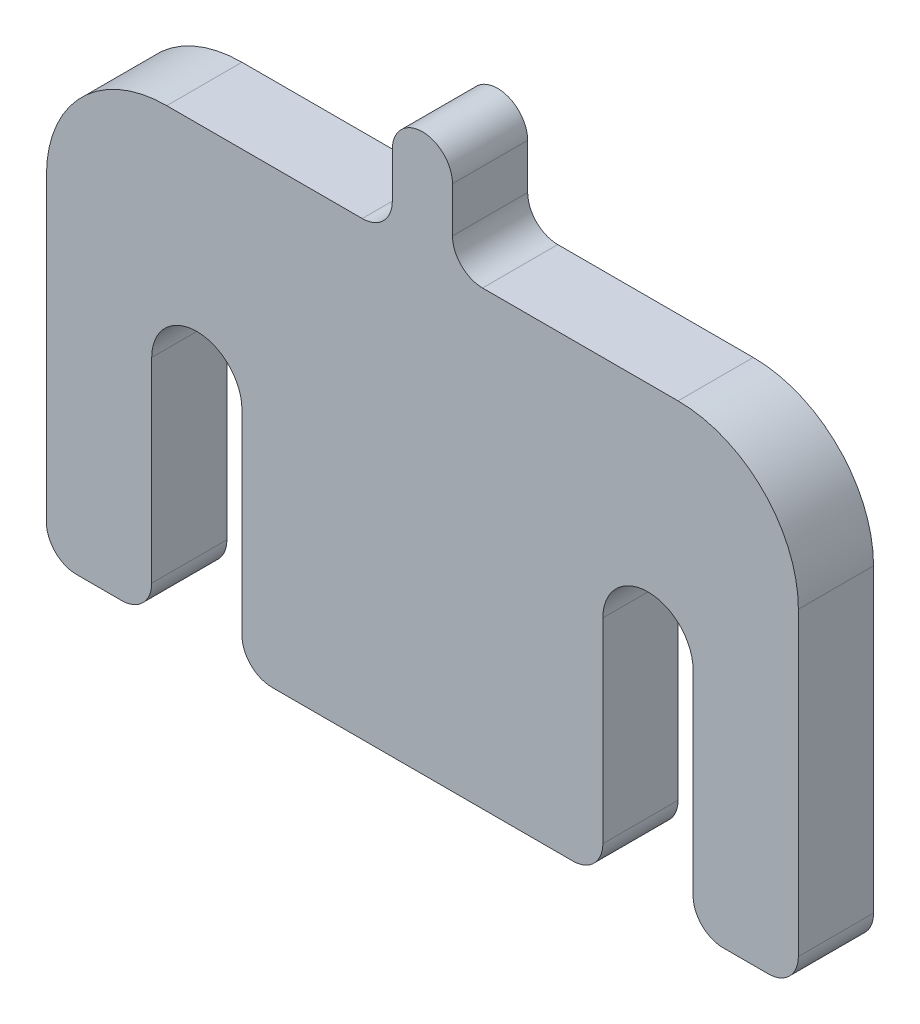
ISO-10303-21;
HEADER;
FILE_DESCRIPTION(('STEP AP214'),'2;1');
FILE_NAME('part.step','',(''),(''),'','','');
FILE_SCHEMA(('AUTOMOTIVE_DESIGN { 1 0 10303 214 1 1 1 1 }'));
ENDSEC;
DATA;
#1=APPLICATION_CONTEXT('core data for automotive mechanical design processes');
#2=APPLICATION_PROTOCOL_DEFINITION('international standard','automotive_design',2000,#1);
#3=PRODUCT_CONTEXT('',#1,'mechanical');
#4=PRODUCT('Part','Part','',(#3));
#5=PRODUCT_RELATED_PRODUCT_CATEGORY('part','',(#4));
#6=PRODUCT_DEFINITION_FORMATION('','',#4);
#7=PRODUCT_DEFINITION_CONTEXT('part definition',#1,'design');
#8=PRODUCT_DEFINITION('design','',#6,#7);
#9=PRODUCT_DEFINITION_SHAPE('','',#8);
#10=(LENGTH_UNIT() NAMED_UNIT(*) SI_UNIT(.MILLI.,.METRE.));
#11=(NAMED_UNIT(*) PLANE_ANGLE_UNIT() SI_UNIT($,.RADIAN.));
#12=(NAMED_UNIT(*) SI_UNIT($,.STERADIAN.) SOLID_ANGLE_UNIT());
#13=UNCERTAINTY_MEASURE_WITH_UNIT(LENGTH_MEASURE(1.E-05),#10,'distance_accuracy_value','');
#14=(GEOMETRIC_REPRESENTATION_CONTEXT(3) GLOBAL_UNCERTAINTY_ASSIGNED_CONTEXT((#13)) GLOBAL_UNIT_ASSIGNED_CONTEXT((#10,
#11,#12)) REPRESENTATION_CONTEXT('',''));
#15=CARTESIAN_POINT('',(0.,0.,0.));
#16=DIRECTION('',(0.,0.,1.));
#17=DIRECTION('',(1.,0.,0.));
#18=AXIS2_PLACEMENT_3D('',#15,#16,#17);
#19=CARTESIAN_POINT('',(15.,0.,-5.));
#20=DIRECTION('',(0.,0.,1.));
#21=DIRECTION('',(-1.,0.,0.));
#22=AXIS2_PLACEMENT_3D('',#19,#20,#21);
#23=CYLINDRICAL_SURFACE('',#22,3.);
#24=CARTESIAN_POINT('',(15.,0.,0.));
#25=DIRECTION('',(0.,0.,1.));
#26=DIRECTION('',(1.,0.,0.));
#27=AXIS2_PLACEMENT_3D('',#24,#25,#26);
#28=CIRCLE('',#27,3.);
#29=CARTESIAN_POINT('',(18.,0.,0.));
#30=VERTEX_POINT('',#29);
#31=CARTESIAN_POINT('',(12.,0.,0.));
#32=VERTEX_POINT('',#31);
#33=EDGE_CURVE('E277',#30,#32,#28,.T.);
#34=ORIENTED_EDGE('',*,*,#33,.T.);
#35=DIRECTION('',(0.,0.,1.));
#36=VECTOR('',#35,1.);
#37=CARTESIAN_POINT('',(12.,0.,-5.));
#38=LINE('',#37,#36);
#39=CARTESIAN_POINT('',(12.,0.,-5.));
#40=VERTEX_POINT('',#39);
#41=EDGE_CURVE('E237',#40,#32,#38,.T.);
#42=ORIENTED_EDGE('',*,*,#41,.F.);
#43=CARTESIAN_POINT('',(15.,0.,-5.));
#44=DIRECTION('',(0.,0.,1.));
#45=DIRECTION('',(1.,0.,0.));
#46=AXIS2_PLACEMENT_3D('',#43,#44,#45);
#47=CIRCLE('',#46,3.);
#48=CARTESIAN_POINT('',(18.,0.,-5.));
#49=VERTEX_POINT('',#48);
#50=EDGE_CURVE('E216',#49,#40,#47,.T.);
#51=ORIENTED_EDGE('',*,*,#50,.F.);
#52=DIRECTION('',(0.,0.,1.));
#53=VECTOR('',#52,1.);
#54=CARTESIAN_POINT('',(18.,0.,-5.));
#55=LINE('',#54,#53);
#56=EDGE_CURVE('E226',#49,#30,#55,.T.);
#57=ORIENTED_EDGE('',*,*,#56,.T.);
#58=EDGE_LOOP('',(#34,#42,#51,#57));
#59=FACE_BOUND('',#58,.T.);
#60=ADVANCED_FACE('F39',(#59),#23,.F.);
#61=CARTESIAN_POINT('',(18.,0.,-5.));
#62=DIRECTION('',(1.,0.,0.));
#63=DIRECTION('',(0.,0.,1.));
#64=AXIS2_PLACEMENT_3D('',#61,#62,#63);
#65=PLANE('',#64);
#66=DIRECTION('',(0.,-1.,0.));
#67=VECTOR('',#66,1.);
#68=CARTESIAN_POINT('',(18.,0.,0.));
#69=LINE('',#68,#67);
#70=CARTESIAN_POINT('',(18.,-13.,0.));
#71=VERTEX_POINT('',#70);
#72=EDGE_CURVE('E229',#30,#71,#69,.T.);
#73=ORIENTED_EDGE('',*,*,#72,.F.);
#74=ORIENTED_EDGE('',*,*,#56,.F.);
#75=DIRECTION('',(0.,-1.,0.));
#76=VECTOR('',#75,1.);
#77=CARTESIAN_POINT('',(18.,0.,-5.));
#78=LINE('',#77,#76);
#79=CARTESIAN_POINT('',(18.,-13.,-5.));
#80=VERTEX_POINT('',#79);
#81=EDGE_CURVE('E210',#49,#80,#78,.T.);
#82=ORIENTED_EDGE('',*,*,#81,.T.);
#83=DIRECTION('',(0.,0.,1.));
#84=VECTOR('',#83,1.);
#85=CARTESIAN_POINT('',(18.,-13.,-5.));
#86=LINE('',#85,#84);
#87=EDGE_CURVE('E384',#71,#80,#86,.F.);
#88=ORIENTED_EDGE('',*,*,#87,.F.);
#89=EDGE_LOOP('',(#73,#74,#82,#88));
#90=FACE_BOUND('',#89,.T.);
#91=ADVANCED_FACE('F227',(#90),#65,.F.);
#92=CARTESIAN_POINT('',(0.,-15.,-5.));
#93=DIRECTION('',(0.,-1.,0.));
#94=DIRECTION('',(1.,0.,0.));
#95=AXIS2_PLACEMENT_3D('',#92,#93,#94);
#96=PLANE('',#95);
#97=DIRECTION('',(-1.,0.,0.));
#98=VECTOR('',#97,1.);
#99=CARTESIAN_POINT('',(0.,-15.,-5.));
#100=LINE('',#99,#98);
#101=CARTESIAN_POINT('',(23.,-15.,-5.));
#102=VERTEX_POINT('',#101);
#103=CARTESIAN_POINT('',(20.,-15.,-5.));
#104=VERTEX_POINT('',#103);
#105=EDGE_CURVE('E223',#102,#104,#100,.T.);
#106=ORIENTED_EDGE('',*,*,#105,.F.);
#107=DIRECTION('',(0.,0.,1.));
#108=VECTOR('',#107,1.);
#109=CARTESIAN_POINT('',(23.,-15.,-5.));
#110=LINE('',#109,#108);
#111=CARTESIAN_POINT('',(23.,-15.,0.));
#112=VERTEX_POINT('',#111);
#113=EDGE_CURVE('E378',#112,#102,#110,.F.);
#114=ORIENTED_EDGE('',*,*,#113,.F.);
#115=DIRECTION('',(-1.,0.,0.));
#116=VECTOR('',#115,1.);
#117=CARTESIAN_POINT('',(0.,-15.,0.));
#118=LINE('',#117,#116);
#119=CARTESIAN_POINT('',(20.,-15.,0.));
#120=VERTEX_POINT('',#119);
#121=EDGE_CURVE('E280',#112,#120,#118,.T.);
#122=ORIENTED_EDGE('',*,*,#121,.T.);
#123=DIRECTION('',(0.,0.,1.));
#124=VECTOR('',#123,1.);
#125=CARTESIAN_POINT('',(20.,-15.,0.));
#126=LINE('',#125,#124);
#127=EDGE_CURVE('E381',#104,#120,#126,.T.);
#128=ORIENTED_EDGE('',*,*,#127,.F.);
#129=EDGE_LOOP('',(#106,#114,#122,#128));
#130=FACE_BOUND('',#129,.T.);
#131=ADVANCED_FACE('F432',(#130),#96,.T.);
#132=CARTESIAN_POINT('',(25.,0.,-5.));
#133=DIRECTION('',(-1.,0.,0.));
#134=DIRECTION('',(0.,0.,-1.));
#135=AXIS2_PLACEMENT_3D('',#132,#133,#134);
#136=PLANE('',#135);
#137=DIRECTION('',(0.,1.,0.));
#138=VECTOR('',#137,1.);
#139=CARTESIAN_POINT('',(25.,0.,0.));
#140=LINE('',#139,#138);
#141=CARTESIAN_POINT('',(25.,-13.,0.));
#142=VERTEX_POINT('',#141);
#143=CARTESIAN_POINT('',(25.,7.,0.));
#144=VERTEX_POINT('',#143);
#145=EDGE_CURVE('E283',#142,#144,#140,.T.);
#146=ORIENTED_EDGE('',*,*,#145,.F.);
#147=DIRECTION('',(0.,0.,1.));
#148=VECTOR('',#147,1.);
#149=CARTESIAN_POINT('',(25.,-13.,0.));
#150=LINE('',#149,#148);
#151=CARTESIAN_POINT('',(25.,-13.,-5.));
#152=VERTEX_POINT('',#151);
#153=EDGE_CURVE('E389',#152,#142,#150,.T.);
#154=ORIENTED_EDGE('',*,*,#153,.F.);
#155=DIRECTION('',(0.,1.,0.));
#156=VECTOR('',#155,1.);
#157=CARTESIAN_POINT('',(25.,0.,-5.));
#158=LINE('',#157,#156);
#159=CARTESIAN_POINT('',(25.,7.,-5.));
#160=VERTEX_POINT('',#159);
#161=EDGE_CURVE('E250',#152,#160,#158,.T.);
#162=ORIENTED_EDGE('',*,*,#161,.T.);
#163=DIRECTION('',(0.,0.,1.));
#164=VECTOR('',#163,1.);
#165=CARTESIAN_POINT('',(25.,7.,-5.));
#166=LINE('',#165,#164);
#167=EDGE_CURVE('E11',#144,#160,#166,.F.);
#168=ORIENTED_EDGE('',*,*,#167,.F.);
#169=EDGE_LOOP('',(#146,#154,#162,#168));
#170=FACE_BOUND('',#169,.T.);
#171=ADVANCED_FACE('F425',(#170),#136,.F.);
#172=CARTESIAN_POINT('',(0.,15.,-5.));
#173=DIRECTION('',(0.,-1.,0.));
#174=DIRECTION('',(1.,0.,0.));
#175=AXIS2_PLACEMENT_3D('',#172,#173,#174);
#176=PLANE('',#175);
#177=DIRECTION('',(-1.,0.,0.));
#178=VECTOR('',#177,1.);
#179=CARTESIAN_POINT('',(0.,15.,-5.));
#180=LINE('',#179,#178);
#181=CARTESIAN_POINT('',(17.,15.,-5.));
#182=VERTEX_POINT('',#181);
#183=CARTESIAN_POINT('',(4.,15.,-5.));
#184=VERTEX_POINT('',#183);
#185=EDGE_CURVE('E253',#182,#184,#180,.T.);
#186=ORIENTED_EDGE('',*,*,#185,.T.);
#187=DIRECTION('',(0.,0.,1.));
#188=VECTOR('',#187,1.);
#189=CARTESIAN_POINT('',(4.,15.,-5.));
#190=LINE('',#189,#188);
#191=CARTESIAN_POINT('',(4.,15.,0.));
#192=VERTEX_POINT('',#191);
#193=EDGE_CURVE('E331',#192,#184,#190,.F.);
#194=ORIENTED_EDGE('',*,*,#193,.F.);
#195=DIRECTION('',(-1.,0.,0.));
#196=VECTOR('',#195,1.);
#197=CARTESIAN_POINT('',(0.,15.,0.));
#198=LINE('',#197,#196);
#199=CARTESIAN_POINT('',(17.,15.,0.));
#200=VERTEX_POINT('',#199);
#201=EDGE_CURVE('E287',#200,#192,#198,.T.);
#202=ORIENTED_EDGE('',*,*,#201,.F.);
#203=DIRECTION('',(0.,0.,1.));
#204=VECTOR('',#203,1.);
#205=CARTESIAN_POINT('',(17.,15.,-5.));
#206=LINE('',#205,#204);
#207=EDGE_CURVE('E47',#182,#200,#206,.T.);
#208=ORIENTED_EDGE('',*,*,#207,.F.);
#209=EDGE_LOOP('',(#186,#194,#202,#208));
#210=FACE_BOUND('',#209,.T.);
#211=ADVANCED_FACE('F416',(#210),#176,.F.);
#212=CARTESIAN_POINT('',(2.,0.,-5.));
#213=DIRECTION('',(1.,0.,0.));
#214=DIRECTION('',(0.,1.,0.));
#215=AXIS2_PLACEMENT_3D('',#212,#213,#214);
#216=PLANE('',#215);
#217=DIRECTION('',(0.,-1.,0.));
#218=VECTOR('',#217,1.);
#219=CARTESIAN_POINT('',(2.,0.,-5.));
#220=LINE('',#219,#218);
#221=CARTESIAN_POINT('',(2.,20.,-5.));
#222=VERTEX_POINT('',#221);
#223=CARTESIAN_POINT('',(2.,17.,-5.));
#224=VERTEX_POINT('',#223);
#225=EDGE_CURVE('E256',#222,#224,#220,.T.);
#226=ORIENTED_EDGE('',*,*,#225,.F.);
#227=DIRECTION('',(0.,0.,1.));
#228=VECTOR('',#227,1.);
#229=CARTESIAN_POINT('',(2.,20.,-5.));
#230=LINE('',#229,#228);
#231=CARTESIAN_POINT('',(2.,20.,0.));
#232=VERTEX_POINT('',#231);
#233=EDGE_CURVE('E234',#222,#232,#230,.T.);
#234=ORIENTED_EDGE('',*,*,#233,.T.);
#235=DIRECTION('',(0.,-1.,0.));
#236=VECTOR('',#235,1.);
#237=CARTESIAN_POINT('',(2.,0.,0.));
#238=LINE('',#237,#236);
#239=CARTESIAN_POINT('',(2.,17.,0.));
#240=VERTEX_POINT('',#239);
#241=EDGE_CURVE('E290',#232,#240,#238,.T.);
#242=ORIENTED_EDGE('',*,*,#241,.T.);
#243=DIRECTION('',(0.,0.,1.));
#244=VECTOR('',#243,1.);
#245=CARTESIAN_POINT('',(2.,17.,-5.));
#246=LINE('',#245,#244);
#247=EDGE_CURVE('E328',#224,#240,#246,.T.);
#248=ORIENTED_EDGE('',*,*,#247,.F.);
#249=EDGE_LOOP('',(#226,#234,#242,#248));
#250=FACE_BOUND('',#249,.T.);
#251=ADVANCED_FACE('F469',(#250),#216,.T.);
#252=CARTESIAN_POINT('',(0.,20.,-5.));
#253=DIRECTION('',(0.,0.,1.));
#254=DIRECTION('',(-1.,0.,0.));
#255=AXIS2_PLACEMENT_3D('',#252,#253,#254);
#256=CYLINDRICAL_SURFACE('',#255,2.00000000000001);
#257=CARTESIAN_POINT('',(0.,20.,0.));
#258=DIRECTION('',(0.,0.,1.));
#259=DIRECTION('',(1.,0.,0.));
#260=AXIS2_PLACEMENT_3D('',#257,#258,#259);
#261=CIRCLE('',#260,2.00000000000001);
#262=CARTESIAN_POINT('',(-2.,20.,0.));
#263=VERTEX_POINT('',#262);
#264=EDGE_CURVE('E294',#232,#263,#261,.T.);
#265=ORIENTED_EDGE('',*,*,#264,.F.);
#266=ORIENTED_EDGE('',*,*,#233,.F.);
#267=CARTESIAN_POINT('',(0.,20.,-5.));
#268=DIRECTION('',(0.,0.,1.));
#269=DIRECTION('',(1.,0.,0.));
#270=AXIS2_PLACEMENT_3D('',#267,#268,#269);
#271=CIRCLE('',#270,2.00000000000001);
#272=CARTESIAN_POINT('',(-2.,20.,-5.));
#273=VERTEX_POINT('',#272);
#274=EDGE_CURVE('E260',#222,#273,#271,.T.);
#275=ORIENTED_EDGE('',*,*,#274,.T.);
#276=DIRECTION('',(0.,0.,1.));
#277=VECTOR('',#276,1.);
#278=CARTESIAN_POINT('',(-2.,20.,-5.));
#279=LINE('',#278,#277);
#280=EDGE_CURVE('E318',#273,#263,#279,.T.);
#281=ORIENTED_EDGE('',*,*,#280,.T.);
#282=EDGE_LOOP('',(#265,#266,#275,#281));
#283=FACE_BOUND('',#282,.T.);
#284=ADVANCED_FACE('F465',(#283),#256,.T.);
#285=CARTESIAN_POINT('',(-2.,0.,-5.));
#286=DIRECTION('',(1.,0.,0.));
#287=DIRECTION('',(0.,1.,0.));
#288=AXIS2_PLACEMENT_3D('',#285,#286,#287);
#289=PLANE('',#288);
#290=DIRECTION('',(0.,-1.,0.));
#291=VECTOR('',#290,1.);
#292=CARTESIAN_POINT('',(-2.,0.,0.));
#293=LINE('',#292,#291);
#294=CARTESIAN_POINT('',(-2.,17.,0.));
#295=VERTEX_POINT('',#294);
#296=EDGE_CURVE('E297',#263,#295,#293,.T.);
#297=ORIENTED_EDGE('',*,*,#296,.F.);
#298=ORIENTED_EDGE('',*,*,#280,.F.);
#299=DIRECTION('',(0.,-1.,0.));
#300=VECTOR('',#299,1.);
#301=CARTESIAN_POINT('',(-2.,0.,-5.));
#302=LINE('',#301,#300);
#303=CARTESIAN_POINT('',(-2.,17.,-5.));
#304=VERTEX_POINT('',#303);
#305=EDGE_CURVE('E263',#273,#304,#302,.T.);
#306=ORIENTED_EDGE('',*,*,#305,.T.);
#307=DIRECTION('',(0.,0.,1.));
#308=VECTOR('',#307,1.);
#309=CARTESIAN_POINT('',(-2.,17.,-5.));
#310=LINE('',#309,#308);
#311=EDGE_CURVE('E325',#295,#304,#310,.F.);
#312=ORIENTED_EDGE('',*,*,#311,.F.);
#313=EDGE_LOOP('',(#297,#298,#306,#312));
#314=FACE_BOUND('',#313,.T.);
#315=ADVANCED_FACE('F463',(#314),#289,.F.);
#316=CARTESIAN_POINT('',(-4.,15.,0.));
#317=VERTEX_POINT('',#316);
#318=CARTESIAN_POINT('',(-17.,15.,0.));
#319=VERTEX_POINT('',#318);
#320=EDGE_CURVE('E291',#317,#319,#198,.T.);
#321=ORIENTED_EDGE('',*,*,#320,.F.);
#322=DIRECTION('',(0.,0.,1.));
#323=VECTOR('',#322,1.);
#324=CARTESIAN_POINT('',(-4.,15.,0.));
#325=LINE('',#324,#323);
#326=CARTESIAN_POINT('',(-4.,15.,-5.));
#327=VERTEX_POINT('',#326);
#328=EDGE_CURVE('E233',#327,#317,#325,.T.);
#329=ORIENTED_EDGE('',*,*,#328,.F.);
#330=CARTESIAN_POINT('',(-17.,15.,-5.));
#331=VERTEX_POINT('',#330);
#332=EDGE_CURVE('E257',#327,#331,#180,.T.);
#333=ORIENTED_EDGE('',*,*,#332,.T.);
#334=DIRECTION('',(0.,0.,1.));
#335=VECTOR('',#334,1.);
#336=CARTESIAN_POINT('',(-17.,15.,-5.));
#337=LINE('',#336,#335);
#338=EDGE_CURVE('E407',#319,#331,#337,.F.);
#339=ORIENTED_EDGE('',*,*,#338,.F.);
#340=EDGE_LOOP('',(#321,#329,#333,#339));
#341=FACE_BOUND('',#340,.T.);
#342=ADVANCED_FACE('F456',(#341),#176,.F.);
#343=CARTESIAN_POINT('',(-25.,0.,-5.));
#344=DIRECTION('',(-1.,0.,0.));
#345=DIRECTION('',(0.,0.,-1.));
#346=AXIS2_PLACEMENT_3D('',#343,#344,#345);
#347=PLANE('',#346);
#348=DIRECTION('',(0.,1.,0.));
#349=VECTOR('',#348,1.);
#350=CARTESIAN_POINT('',(-25.,0.,-5.));
#351=LINE('',#350,#349);
#352=CARTESIAN_POINT('',(-25.,-13.,-5.));
#353=VERTEX_POINT('',#352);
#354=CARTESIAN_POINT('',(-25.,6.99999999999999,-5.));
#355=VERTEX_POINT('',#354);
#356=EDGE_CURVE('E266',#353,#355,#351,.T.);
#357=ORIENTED_EDGE('',*,*,#356,.F.);
#358=DIRECTION('',(0.,0.,1.));
#359=VECTOR('',#358,1.);
#360=CARTESIAN_POINT('',(-25.,-13.,-5.));
#361=LINE('',#360,#359);
#362=CARTESIAN_POINT('',(-25.,-13.,0.));
#363=VERTEX_POINT('',#362);
#364=EDGE_CURVE('E386',#363,#353,#361,.F.);
#365=ORIENTED_EDGE('',*,*,#364,.F.);
#366=DIRECTION('',(0.,1.,0.));
#367=VECTOR('',#366,1.);
#368=CARTESIAN_POINT('',(-25.,0.,0.));
#369=LINE('',#368,#367);
#370=CARTESIAN_POINT('',(-25.,6.99999999999999,0.));
#371=VERTEX_POINT('',#370);
#372=EDGE_CURVE('E300',#363,#371,#369,.T.);
#373=ORIENTED_EDGE('',*,*,#372,.T.);
#374=DIRECTION('',(0.,0.,1.));
#375=VECTOR('',#374,1.);
#376=CARTESIAN_POINT('',(-25.,6.99999999999999,0.));
#377=LINE('',#376,#375);
#378=EDGE_CURVE('E400',#355,#371,#377,.T.);
#379=ORIENTED_EDGE('',*,*,#378,.F.);
#380=EDGE_LOOP('',(#357,#365,#373,#379));
#381=FACE_BOUND('',#380,.T.);
#382=ADVANCED_FACE('F447',(#381),#347,.T.);
#383=CARTESIAN_POINT('',(-20.,-15.,0.));
#384=VERTEX_POINT('',#383);
#385=CARTESIAN_POINT('',(-23.,-15.,0.));
#386=VERTEX_POINT('',#385);
#387=EDGE_CURVE('E284',#384,#386,#118,.T.);
#388=ORIENTED_EDGE('',*,*,#387,.T.);
#389=DIRECTION('',(0.,0.,1.));
#390=VECTOR('',#389,1.);
#391=CARTESIAN_POINT('',(-23.,-15.,-5.));
#392=LINE('',#391,#390);
#393=CARTESIAN_POINT('',(-23.,-15.,-5.));
#394=VERTEX_POINT('',#393);
#395=EDGE_CURVE('E349',#394,#386,#392,.T.);
#396=ORIENTED_EDGE('',*,*,#395,.F.);
#397=CARTESIAN_POINT('',(-20.,-15.,-5.));
#398=VERTEX_POINT('',#397);
#399=EDGE_CURVE('E249',#398,#394,#100,.T.);
#400=ORIENTED_EDGE('',*,*,#399,.F.);
#401=DIRECTION('',(0.,0.,1.));
#402=VECTOR('',#401,1.);
#403=CARTESIAN_POINT('',(-20.,-15.,-5.));
#404=LINE('',#403,#402);
#405=EDGE_CURVE('E352',#384,#398,#404,.F.);
#406=ORIENTED_EDGE('',*,*,#405,.F.);
#407=EDGE_LOOP('',(#388,#396,#400,#406));
#408=FACE_BOUND('',#407,.T.);
#409=ADVANCED_FACE('F439',(#408),#96,.T.);
#410=CARTESIAN_POINT('',(-18.,0.,-5.));
#411=DIRECTION('',(1.,0.,0.));
#412=DIRECTION('',(0.,1.,0.));
#413=AXIS2_PLACEMENT_3D('',#410,#411,#412);
#414=PLANE('',#413);
#415=DIRECTION('',(0.,-1.,0.));
#416=VECTOR('',#415,1.);
#417=CARTESIAN_POINT('',(-18.,0.,-5.));
#418=LINE('',#417,#416);
#419=CARTESIAN_POINT('',(-18.,0.,-5.));
#420=VERTEX_POINT('',#419);
#421=CARTESIAN_POINT('',(-18.,-13.,-5.));
#422=VERTEX_POINT('',#421);
#423=EDGE_CURVE('E269',#420,#422,#418,.T.);
#424=ORIENTED_EDGE('',*,*,#423,.F.);
#425=DIRECTION('',(0.,0.,1.));
#426=VECTOR('',#425,1.);
#427=CARTESIAN_POINT('',(-18.,0.,-5.));
#428=LINE('',#427,#426);
#429=CARTESIAN_POINT('',(-18.,0.,0.));
#430=VERTEX_POINT('',#429);
#431=EDGE_CURVE('E315',#420,#430,#428,.T.);
#432=ORIENTED_EDGE('',*,*,#431,.T.);
#433=DIRECTION('',(0.,-1.,0.));
#434=VECTOR('',#433,1.);
#435=CARTESIAN_POINT('',(-18.,0.,0.));
#436=LINE('',#435,#434);
#437=CARTESIAN_POINT('',(-18.,-13.,0.));
#438=VERTEX_POINT('',#437);
#439=EDGE_CURVE('E303',#430,#438,#436,.T.);
#440=ORIENTED_EDGE('',*,*,#439,.T.);
#441=DIRECTION('',(0.,0.,1.));
#442=VECTOR('',#441,1.);
#443=CARTESIAN_POINT('',(-18.,-13.,-5.));
#444=LINE('',#443,#442);
#445=EDGE_CURVE('E334',#422,#438,#444,.T.);
#446=ORIENTED_EDGE('',*,*,#445,.F.);
#447=EDGE_LOOP('',(#424,#432,#440,#446));
#448=FACE_BOUND('',#447,.T.);
#449=ADVANCED_FACE('F628',(#448),#414,.T.);
#450=CARTESIAN_POINT('',(-15.,0.,-5.));
#451=DIRECTION('',(0.,0.,1.));
#452=DIRECTION('',(-1.,0.,0.));
#453=AXIS2_PLACEMENT_3D('',#450,#451,#452);
#454=CYLINDRICAL_SURFACE('',#453,3.);
#455=CARTESIAN_POINT('',(-15.,0.,0.));
#456=DIRECTION('',(0.,0.,1.));
#457=DIRECTION('',(1.,0.,0.));
#458=AXIS2_PLACEMENT_3D('',#455,#456,#457);
#459=CIRCLE('',#458,3.);
#460=CARTESIAN_POINT('',(-12.,0.,0.));
#461=VERTEX_POINT('',#460);
#462=EDGE_CURVE('E306',#461,#430,#459,.T.);
#463=ORIENTED_EDGE('',*,*,#462,.T.);
#464=ORIENTED_EDGE('',*,*,#431,.F.);
#465=CARTESIAN_POINT('',(-15.,0.,-5.));
#466=DIRECTION('',(0.,0.,1.));
#467=DIRECTION('',(1.,0.,0.));
#468=AXIS2_PLACEMENT_3D('',#465,#466,#467);
#469=CIRCLE('',#468,3.);
#470=CARTESIAN_POINT('',(-12.,0.,-5.));
#471=VERTEX_POINT('',#470);
#472=EDGE_CURVE('E272',#471,#420,#469,.T.);
#473=ORIENTED_EDGE('',*,*,#472,.F.);
#474=DIRECTION('',(0.,0.,1.));
#475=VECTOR('',#474,1.);
#476=CARTESIAN_POINT('',(-12.,0.,-5.));
#477=LINE('',#476,#475);
#478=EDGE_CURVE('E312',#471,#461,#477,.T.);
#479=ORIENTED_EDGE('',*,*,#478,.T.);
#480=EDGE_LOOP('',(#463,#464,#473,#479));
#481=FACE_BOUND('',#480,.T.);
#482=ADVANCED_FACE('F619',(#481),#454,.F.);
#483=CARTESIAN_POINT('',(-12.,0.,-5.));
#484=DIRECTION('',(1.,0.,0.));
#485=DIRECTION('',(0.,1.,0.));
#486=AXIS2_PLACEMENT_3D('',#483,#484,#485);
#487=PLANE('',#486);
#488=DIRECTION('',(0.,-1.,0.));
#489=VECTOR('',#488,1.);
#490=CARTESIAN_POINT('',(-12.,0.,0.));
#491=LINE('',#490,#489);
#492=CARTESIAN_POINT('',(-12.,-13.,0.));
#493=VERTEX_POINT('',#492);
#494=EDGE_CURVE('E308',#461,#493,#491,.T.);
#495=ORIENTED_EDGE('',*,*,#494,.F.);
#496=ORIENTED_EDGE('',*,*,#478,.F.);
#497=DIRECTION('',(0.,-1.,0.));
#498=VECTOR('',#497,1.);
#499=CARTESIAN_POINT('',(-12.,0.,-5.));
#500=LINE('',#499,#498);
#501=CARTESIAN_POINT('',(-12.,-13.,-5.));
#502=VERTEX_POINT('',#501);
#503=EDGE_CURVE('E248',#471,#502,#500,.T.);
#504=ORIENTED_EDGE('',*,*,#503,.T.);
#505=DIRECTION('',(0.,0.,1.));
#506=VECTOR('',#505,1.);
#507=CARTESIAN_POINT('',(-12.,-13.,-5.));
#508=LINE('',#507,#506);
#509=EDGE_CURVE('E372',#493,#502,#508,.F.);
#510=ORIENTED_EDGE('',*,*,#509,.F.);
#511=EDGE_LOOP('',(#495,#496,#504,#510));
#512=FACE_BOUND('',#511,.T.);
#513=ADVANCED_FACE('F611',(#512),#487,.F.);
#514=CARTESIAN_POINT('',(10.,-15.,-5.));
#515=VERTEX_POINT('',#514);
#516=CARTESIAN_POINT('',(-10.,-15.,-5.));
#517=VERTEX_POINT('',#516);
#518=EDGE_CURVE('E244',#515,#517,#100,.T.);
#519=ORIENTED_EDGE('',*,*,#518,.F.);
#520=DIRECTION('',(0.,0.,1.));
#521=VECTOR('',#520,1.);
#522=CARTESIAN_POINT('',(10.,-15.,-5.));
#523=LINE('',#522,#521);
#524=CARTESIAN_POINT('',(10.,-15.,0.));
#525=VERTEX_POINT('',#524);
#526=EDGE_CURVE('E366',#525,#515,#523,.F.);
#527=ORIENTED_EDGE('',*,*,#526,.F.);
#528=CARTESIAN_POINT('',(-10.,-15.,0.));
#529=VERTEX_POINT('',#528);
#530=EDGE_CURVE('E241',#525,#529,#118,.T.);
#531=ORIENTED_EDGE('',*,*,#530,.T.);
#532=DIRECTION('',(0.,0.,1.));
#533=VECTOR('',#532,1.);
#534=CARTESIAN_POINT('',(-10.,-15.,0.));
#535=LINE('',#534,#533);
#536=EDGE_CURVE('E369',#517,#529,#535,.T.);
#537=ORIENTED_EDGE('',*,*,#536,.F.);
#538=EDGE_LOOP('',(#519,#527,#531,#537));
#539=FACE_BOUND('',#538,.T.);
#540=ADVANCED_FACE('F479',(#539),#96,.T.);
#541=CARTESIAN_POINT('',(12.,0.,-5.));
#542=DIRECTION('',(1.,0.,0.));
#543=DIRECTION('',(0.,1.,0.));
#544=AXIS2_PLACEMENT_3D('',#541,#542,#543);
#545=PLANE('',#544);
#546=DIRECTION('',(0.,-1.,0.));
#547=VECTOR('',#546,1.);
#548=CARTESIAN_POINT('',(12.,0.,-5.));
#549=LINE('',#548,#547);
#550=CARTESIAN_POINT('',(12.,-13.,-5.));
#551=VERTEX_POINT('',#550);
#552=EDGE_CURVE('E247',#40,#551,#549,.T.);
#553=ORIENTED_EDGE('',*,*,#552,.F.);
#554=ORIENTED_EDGE('',*,*,#41,.T.);
#555=DIRECTION('',(0.,-1.,0.));
#556=VECTOR('',#555,1.);
#557=CARTESIAN_POINT('',(12.,0.,0.));
#558=LINE('',#557,#556);
#559=CARTESIAN_POINT('',(12.,-13.,0.));
#560=VERTEX_POINT('',#559);
#561=EDGE_CURVE('E238',#32,#560,#558,.T.);
#562=ORIENTED_EDGE('',*,*,#561,.T.);
#563=DIRECTION('',(0.,0.,1.));
#564=VECTOR('',#563,1.);
#565=CARTESIAN_POINT('',(12.,-13.,-5.));
#566=LINE('',#565,#564);
#567=EDGE_CURVE('E375',#551,#560,#566,.T.);
#568=ORIENTED_EDGE('',*,*,#567,.F.);
#569=EDGE_LOOP('',(#553,#554,#562,#568));
#570=FACE_BOUND('',#569,.T.);
#571=ADVANCED_FACE('F489',(#570),#545,.T.);
#572=CARTESIAN_POINT('',(0.,0.,-5.));
#573=DIRECTION('',(0.,0.,-1.));
#574=DIRECTION('',(1.,0.,0.));
#575=AXIS2_PLACEMENT_3D('',#572,#573,#574);
#576=PLANE('',#575);
#577=ORIENTED_EDGE('',*,*,#332,.F.);
#578=CARTESIAN_POINT('',(-4.,17.,-5.));
#579=DIRECTION('',(0.,0.,1.));
#580=DIRECTION('',(1.,0.,0.));
#581=AXIS2_PLACEMENT_3D('',#578,#579,#580);
#582=CIRCLE('',#581,2.);
#583=EDGE_CURVE('E394',#304,#327,#582,.F.);
#584=ORIENTED_EDGE('',*,*,#583,.F.);
#585=ORIENTED_EDGE('',*,*,#305,.F.);
#586=ORIENTED_EDGE('',*,*,#274,.F.);
#587=ORIENTED_EDGE('',*,*,#225,.T.);
#588=CARTESIAN_POINT('',(4.,17.,-5.));
#589=DIRECTION('',(0.,0.,1.));
#590=DIRECTION('',(1.,0.,0.));
#591=AXIS2_PLACEMENT_3D('',#588,#589,#590);
#592=CIRCLE('',#591,2.);
#593=EDGE_CURVE('E398',#184,#224,#592,.F.);
#594=ORIENTED_EDGE('',*,*,#593,.F.);
#595=ORIENTED_EDGE('',*,*,#185,.F.);
#596=CARTESIAN_POINT('',(17.,7.,-5.));
#597=DIRECTION('',(0.,0.,1.));
#598=DIRECTION('',(1.,0.,0.));
#599=AXIS2_PLACEMENT_3D('',#596,#597,#598);
#600=CIRCLE('',#599,8.);
#601=EDGE_CURVE('E53',#160,#182,#600,.T.);
#602=ORIENTED_EDGE('',*,*,#601,.F.);
#603=ORIENTED_EDGE('',*,*,#161,.F.);
#604=CARTESIAN_POINT('',(23.,-13.,-5.));
#605=DIRECTION('',(0.,0.,1.));
#606=DIRECTION('',(1.,0.,0.));
#607=AXIS2_PLACEMENT_3D('',#604,#605,#606);
#608=CIRCLE('',#607,2.);
#609=EDGE_CURVE('E355',#102,#152,#608,.T.);
#610=ORIENTED_EDGE('',*,*,#609,.F.);
#611=ORIENTED_EDGE('',*,*,#105,.T.);
#612=CARTESIAN_POINT('',(20.,-13.,-5.));
#613=DIRECTION('',(0.,0.,1.));
#614=DIRECTION('',(1.,0.,0.));
#615=AXIS2_PLACEMENT_3D('',#612,#613,#614);
#616=CIRCLE('',#615,2.);
#617=EDGE_CURVE('E219',#80,#104,#616,.T.);
#618=ORIENTED_EDGE('',*,*,#617,.F.);
#619=ORIENTED_EDGE('',*,*,#81,.F.);
#620=ORIENTED_EDGE('',*,*,#50,.T.);
#621=ORIENTED_EDGE('',*,*,#552,.T.);
#622=CARTESIAN_POINT('',(10.,-13.,-5.));
#623=DIRECTION('',(0.,0.,1.));
#624=DIRECTION('',(1.,0.,0.));
#625=AXIS2_PLACEMENT_3D('',#622,#623,#624);
#626=CIRCLE('',#625,2.);
#627=EDGE_CURVE('E360',#515,#551,#626,.T.);
#628=ORIENTED_EDGE('',*,*,#627,.F.);
#629=ORIENTED_EDGE('',*,*,#518,.T.);
#630=CARTESIAN_POINT('',(-10.,-13.,-5.));
#631=DIRECTION('',(0.,0.,1.));
#632=DIRECTION('',(1.,0.,0.));
#633=AXIS2_PLACEMENT_3D('',#630,#631,#632);
#634=CIRCLE('',#633,2.);
#635=EDGE_CURVE('E362',#502,#517,#634,.T.);
#636=ORIENTED_EDGE('',*,*,#635,.F.);
#637=ORIENTED_EDGE('',*,*,#503,.F.);
#638=ORIENTED_EDGE('',*,*,#472,.T.);
#639=ORIENTED_EDGE('',*,*,#423,.T.);
#640=CARTESIAN_POINT('',(-20.,-13.,-5.));
#641=DIRECTION('',(0.,0.,1.));
#642=DIRECTION('',(1.,0.,0.));
#643=AXIS2_PLACEMENT_3D('',#640,#641,#642);
#644=CIRCLE('',#643,2.);
#645=EDGE_CURVE('E364',#398,#422,#644,.T.);
#646=ORIENTED_EDGE('',*,*,#645,.F.);
#647=ORIENTED_EDGE('',*,*,#399,.T.);
#648=CARTESIAN_POINT('',(-23.,-13.,-5.));
#649=DIRECTION('',(0.,0.,1.));
#650=DIRECTION('',(1.,0.,0.));
#651=AXIS2_PLACEMENT_3D('',#648,#649,#650);
#652=CIRCLE('',#651,2.);
#653=EDGE_CURVE('E357',#353,#394,#652,.T.);
#654=ORIENTED_EDGE('',*,*,#653,.F.);
#655=ORIENTED_EDGE('',*,*,#356,.T.);
#656=CARTESIAN_POINT('',(-17.,6.99999999999999,-5.));
#657=DIRECTION('',(0.,0.,1.));
#658=DIRECTION('',(1.,0.,0.));
#659=AXIS2_PLACEMENT_3D('',#656,#657,#658);
#660=CIRCLE('',#659,8.);
#661=EDGE_CURVE('E411',#331,#355,#660,.T.);
#662=ORIENTED_EDGE('',*,*,#661,.F.);
#663=EDGE_LOOP('',(#577,#584,#585,#586,#587,#594,#595,#602,#603,#610,#611,#618,#619,#620,#621,
#628,#629,#636,#637,#638,#639,#646,#647,#654,#655,#662));
#664=FACE_BOUND('',#663,.T.);
#665=ADVANCED_FACE('F213',(#664),#576,.T.);
#666=CARTESIAN_POINT('',(0.,0.,0.));
#667=DIRECTION('',(0.,0.,-1.));
#668=DIRECTION('',(1.,0.,0.));
#669=AXIS2_PLACEMENT_3D('',#666,#667,#668);
#670=PLANE('',#669);
#671=ORIENTED_EDGE('',*,*,#372,.F.);
#672=CARTESIAN_POINT('',(-23.,-13.,0.));
#673=DIRECTION('',(0.,0.,1.));
#674=DIRECTION('',(1.,0.,0.));
#675=AXIS2_PLACEMENT_3D('',#672,#673,#674);
#676=CIRCLE('',#675,2.);
#677=EDGE_CURVE('E339',#386,#363,#676,.F.);
#678=ORIENTED_EDGE('',*,*,#677,.F.);
#679=ORIENTED_EDGE('',*,*,#387,.F.);
#680=CARTESIAN_POINT('',(-20.,-13.,0.));
#681=DIRECTION('',(0.,0.,1.));
#682=DIRECTION('',(1.,0.,0.));
#683=AXIS2_PLACEMENT_3D('',#680,#681,#682);
#684=CIRCLE('',#683,2.);
#685=EDGE_CURVE('E347',#438,#384,#684,.F.);
#686=ORIENTED_EDGE('',*,*,#685,.F.);
#687=ORIENTED_EDGE('',*,*,#439,.F.);
#688=ORIENTED_EDGE('',*,*,#462,.F.);
#689=ORIENTED_EDGE('',*,*,#494,.T.);
#690=CARTESIAN_POINT('',(-10.,-13.,0.));
#691=DIRECTION('',(0.,0.,1.));
#692=DIRECTION('',(1.,0.,0.));
#693=AXIS2_PLACEMENT_3D('',#690,#691,#692);
#694=CIRCLE('',#693,2.);
#695=EDGE_CURVE('E345',#529,#493,#694,.F.);
#696=ORIENTED_EDGE('',*,*,#695,.F.);
#697=ORIENTED_EDGE('',*,*,#530,.F.);
#698=CARTESIAN_POINT('',(10.,-13.,0.));
#699=DIRECTION('',(0.,0.,1.));
#700=DIRECTION('',(1.,0.,0.));
#701=AXIS2_PLACEMENT_3D('',#698,#699,#700);
#702=CIRCLE('',#701,2.);
#703=EDGE_CURVE('E343',#560,#525,#702,.F.);
#704=ORIENTED_EDGE('',*,*,#703,.F.);
#705=ORIENTED_EDGE('',*,*,#561,.F.);
#706=ORIENTED_EDGE('',*,*,#33,.F.);
#707=ORIENTED_EDGE('',*,*,#72,.T.);
#708=CARTESIAN_POINT('',(20.,-13.,0.));
#709=DIRECTION('',(0.,0.,1.));
#710=DIRECTION('',(1.,0.,0.));
#711=AXIS2_PLACEMENT_3D('',#708,#709,#710);
#712=CIRCLE('',#711,2.);
#713=EDGE_CURVE('E341',#120,#71,#712,.F.);
#714=ORIENTED_EDGE('',*,*,#713,.F.);
#715=ORIENTED_EDGE('',*,*,#121,.F.);
#716=CARTESIAN_POINT('',(23.,-13.,0.));
#717=DIRECTION('',(0.,0.,1.));
#718=DIRECTION('',(1.,0.,0.));
#719=AXIS2_PLACEMENT_3D('',#716,#717,#718);
#720=CIRCLE('',#719,2.);
#721=EDGE_CURVE('E337',#142,#112,#720,.F.);
#722=ORIENTED_EDGE('',*,*,#721,.F.);
#723=ORIENTED_EDGE('',*,*,#145,.T.);
#724=CARTESIAN_POINT('',(17.,7.,0.));
#725=DIRECTION('',(0.,0.,1.));
#726=DIRECTION('',(1.,0.,0.));
#727=AXIS2_PLACEMENT_3D('',#724,#725,#726);
#728=CIRCLE('',#727,8.);
#729=EDGE_CURVE('E403',#200,#144,#728,.F.);
#730=ORIENTED_EDGE('',*,*,#729,.F.);
#731=ORIENTED_EDGE('',*,*,#201,.T.);
#732=CARTESIAN_POINT('',(4.,17.,0.));
#733=DIRECTION('',(0.,0.,1.));
#734=DIRECTION('',(1.,0.,0.));
#735=AXIS2_PLACEMENT_3D('',#732,#733,#734);
#736=CIRCLE('',#735,2.);
#737=EDGE_CURVE('E396',#240,#192,#736,.T.);
#738=ORIENTED_EDGE('',*,*,#737,.F.);
#739=ORIENTED_EDGE('',*,*,#241,.F.);
#740=ORIENTED_EDGE('',*,*,#264,.T.);
#741=ORIENTED_EDGE('',*,*,#296,.T.);
#742=CARTESIAN_POINT('',(-4.,17.,0.));
#743=DIRECTION('',(0.,0.,1.));
#744=DIRECTION('',(1.,0.,0.));
#745=AXIS2_PLACEMENT_3D('',#742,#743,#744);
#746=CIRCLE('',#745,2.);
#747=EDGE_CURVE('E392',#317,#295,#746,.T.);
#748=ORIENTED_EDGE('',*,*,#747,.F.);
#749=ORIENTED_EDGE('',*,*,#320,.T.);
#750=CARTESIAN_POINT('',(-17.,6.99999999999999,0.));
#751=DIRECTION('',(0.,0.,1.));
#752=DIRECTION('',(1.,0.,0.));
#753=AXIS2_PLACEMENT_3D('',#750,#751,#752);
#754=CIRCLE('',#753,8.);
#755=EDGE_CURVE('E405',#371,#319,#754,.F.);
#756=ORIENTED_EDGE('',*,*,#755,.F.);
#757=EDGE_LOOP('',(#671,#678,#679,#686,#687,#688,#689,#696,#697,#704,#705,#706,#707,#714,#715,
#722,#723,#730,#731,#738,#739,#740,#741,#748,#749,#756));
#758=FACE_BOUND('',#757,.T.);
#759=ADVANCED_FACE('F419',(#758),#670,.F.);
#760=CARTESIAN_POINT('',(-4.,17.,-5.));
#761=DIRECTION('',(0.,0.,-1.));
#762=DIRECTION('',(1.,0.,0.));
#763=AXIS2_PLACEMENT_3D('',#760,#761,#762);
#764=CYLINDRICAL_SURFACE('',#763,2.);
#765=ORIENTED_EDGE('',*,*,#583,.T.);
#766=ORIENTED_EDGE('',*,*,#328,.T.);
#767=ORIENTED_EDGE('',*,*,#747,.T.);
#768=ORIENTED_EDGE('',*,*,#311,.T.);
#769=EDGE_LOOP('',(#765,#766,#767,#768));
#770=FACE_BOUND('',#769,.T.);
#771=ADVANCED_FACE('F458',(#770),#764,.F.);
#772=CARTESIAN_POINT('',(4.,17.,-5.));
#773=DIRECTION('',(0.,0.,1.));
#774=DIRECTION('',(-1.,0.,0.));
#775=AXIS2_PLACEMENT_3D('',#772,#773,#774);
#776=CYLINDRICAL_SURFACE('',#775,2.);
#777=ORIENTED_EDGE('',*,*,#593,.T.);
#778=ORIENTED_EDGE('',*,*,#247,.T.);
#779=ORIENTED_EDGE('',*,*,#737,.T.);
#780=ORIENTED_EDGE('',*,*,#193,.T.);
#781=EDGE_LOOP('',(#777,#778,#779,#780));
#782=FACE_BOUND('',#781,.T.);
#783=ADVANCED_FACE('F471',(#782),#776,.F.);
#784=CARTESIAN_POINT('',(-20.,-13.,-5.));
#785=DIRECTION('',(0.,0.,1.));
#786=DIRECTION('',(-1.,0.,0.));
#787=AXIS2_PLACEMENT_3D('',#784,#785,#786);
#788=CYLINDRICAL_SURFACE('',#787,2.);
#789=ORIENTED_EDGE('',*,*,#645,.T.);
#790=ORIENTED_EDGE('',*,*,#445,.T.);
#791=ORIENTED_EDGE('',*,*,#685,.T.);
#792=ORIENTED_EDGE('',*,*,#405,.T.);
#793=EDGE_LOOP('',(#789,#790,#791,#792));
#794=FACE_BOUND('',#793,.T.);
#795=ADVANCED_FACE('F512',(#794),#788,.T.);
#796=CARTESIAN_POINT('',(-10.,-13.,-5.));
#797=DIRECTION('',(0.,0.,-1.));
#798=DIRECTION('',(1.,0.,0.));
#799=AXIS2_PLACEMENT_3D('',#796,#797,#798);
#800=CYLINDRICAL_SURFACE('',#799,2.);
#801=ORIENTED_EDGE('',*,*,#635,.T.);
#802=ORIENTED_EDGE('',*,*,#536,.T.);
#803=ORIENTED_EDGE('',*,*,#695,.T.);
#804=ORIENTED_EDGE('',*,*,#509,.T.);
#805=EDGE_LOOP('',(#801,#802,#803,#804));
#806=FACE_BOUND('',#805,.T.);
#807=ADVANCED_FACE('F483',(#806),#800,.T.);
#808=CARTESIAN_POINT('',(10.,-13.,-5.));
#809=DIRECTION('',(0.,0.,1.));
#810=DIRECTION('',(-1.,0.,0.));
#811=AXIS2_PLACEMENT_3D('',#808,#809,#810);
#812=CYLINDRICAL_SURFACE('',#811,2.);
#813=ORIENTED_EDGE('',*,*,#627,.T.);
#814=ORIENTED_EDGE('',*,*,#567,.T.);
#815=ORIENTED_EDGE('',*,*,#703,.T.);
#816=ORIENTED_EDGE('',*,*,#526,.T.);
#817=EDGE_LOOP('',(#813,#814,#815,#816));
#818=FACE_BOUND('',#817,.T.);
#819=ADVANCED_FACE('F487',(#818),#812,.T.);
#820=CARTESIAN_POINT('',(20.,-13.,-5.));
#821=DIRECTION('',(0.,0.,-1.));
#822=DIRECTION('',(1.,0.,0.));
#823=AXIS2_PLACEMENT_3D('',#820,#821,#822);
#824=CYLINDRICAL_SURFACE('',#823,2.);
#825=ORIENTED_EDGE('',*,*,#617,.T.);
#826=ORIENTED_EDGE('',*,*,#127,.T.);
#827=ORIENTED_EDGE('',*,*,#713,.T.);
#828=ORIENTED_EDGE('',*,*,#87,.T.);
#829=EDGE_LOOP('',(#825,#826,#827,#828));
#830=FACE_BOUND('',#829,.T.);
#831=ADVANCED_FACE('F491',(#830),#824,.T.);
#832=CARTESIAN_POINT('',(-23.,-13.,-5.));
#833=DIRECTION('',(0.,0.,1.));
#834=DIRECTION('',(-1.,0.,0.));
#835=AXIS2_PLACEMENT_3D('',#832,#833,#834);
#836=CYLINDRICAL_SURFACE('',#835,2.);
#837=ORIENTED_EDGE('',*,*,#653,.T.);
#838=ORIENTED_EDGE('',*,*,#395,.T.);
#839=ORIENTED_EDGE('',*,*,#677,.T.);
#840=ORIENTED_EDGE('',*,*,#364,.T.);
#841=EDGE_LOOP('',(#837,#838,#839,#840));
#842=FACE_BOUND('',#841,.T.);
#843=ADVANCED_FACE('F442',(#842),#836,.T.);
#844=CARTESIAN_POINT('',(23.,-13.,-5.));
#845=DIRECTION('',(0.,0.,-1.));
#846=DIRECTION('',(1.,0.,0.));
#847=AXIS2_PLACEMENT_3D('',#844,#845,#846);
#848=CYLINDRICAL_SURFACE('',#847,2.);
#849=ORIENTED_EDGE('',*,*,#609,.T.);
#850=ORIENTED_EDGE('',*,*,#153,.T.);
#851=ORIENTED_EDGE('',*,*,#721,.T.);
#852=ORIENTED_EDGE('',*,*,#113,.T.);
#853=EDGE_LOOP('',(#849,#850,#851,#852));
#854=FACE_BOUND('',#853,.T.);
#855=ADVANCED_FACE('F429',(#854),#848,.T.);
#856=CARTESIAN_POINT('',(-17.,6.99999999999999,-5.));
#857=DIRECTION('',(0.,0.,-1.));
#858=DIRECTION('',(1.,0.,0.));
#859=AXIS2_PLACEMENT_3D('',#856,#857,#858);
#860=CYLINDRICAL_SURFACE('',#859,8.);
#861=ORIENTED_EDGE('',*,*,#661,.T.);
#862=ORIENTED_EDGE('',*,*,#378,.T.);
#863=ORIENTED_EDGE('',*,*,#755,.T.);
#864=ORIENTED_EDGE('',*,*,#338,.T.);
#865=EDGE_LOOP('',(#861,#862,#863,#864));
#866=FACE_BOUND('',#865,.T.);
#867=ADVANCED_FACE('F452',(#866),#860,.T.);
#868=CARTESIAN_POINT('',(17.,7.,-5.));
#869=DIRECTION('',(0.,0.,1.));
#870=DIRECTION('',(-1.,0.,0.));
#871=AXIS2_PLACEMENT_3D('',#868,#869,#870);
#872=CYLINDRICAL_SURFACE('',#871,8.);
#873=ORIENTED_EDGE('',*,*,#601,.T.);
#874=ORIENTED_EDGE('',*,*,#207,.T.);
#875=ORIENTED_EDGE('',*,*,#729,.T.);
#876=ORIENTED_EDGE('',*,*,#167,.T.);
#877=EDGE_LOOP('',(#873,#874,#875,#876));
#878=FACE_BOUND('',#877,.T.);
#879=ADVANCED_FACE('F41',(#878),#872,.T.);
#880=CLOSED_SHELL('',(#60,#91,#131,#171,#211,#251,#284,#315,#342,#382,#409,#449,#482,#513,#540,
#571,#665,#759,#771,#783,#795,#807,#819,#831,#843,#855,#867,#879));
#881=MANIFOLD_SOLID_BREP('B2',#880);
#882=ADVANCED_BREP_SHAPE_REPRESENTATION('',(#18,#881),#14);
#883=SHAPE_DEFINITION_REPRESENTATION(#9,#882);
ENDSEC;
END-ISO-10303-21;
